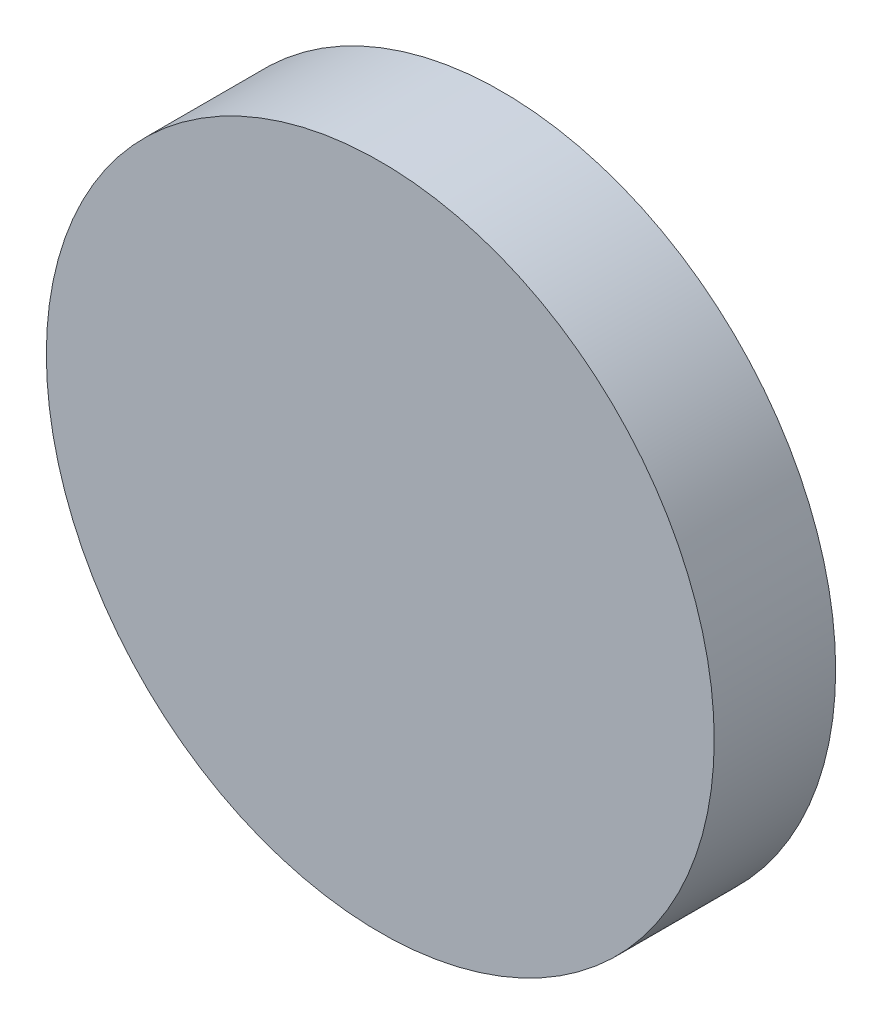
ISO-10303-21;
HEADER;
FILE_DESCRIPTION(('STEP AP214'),'2;1');
FILE_NAME('part.step','',(''),(''),'','','');
FILE_SCHEMA(('AUTOMOTIVE_DESIGN { 1 0 10303 214 1 1 1 1 }'));
ENDSEC;
DATA;
#1=APPLICATION_CONTEXT('core data for automotive mechanical design processes');
#2=APPLICATION_PROTOCOL_DEFINITION('international standard','automotive_design',2000,#1);
#3=PRODUCT_CONTEXT('',#1,'mechanical');
#4=PRODUCT('Part','Part','',(#3));
#5=PRODUCT_RELATED_PRODUCT_CATEGORY('part','',(#4));
#6=PRODUCT_DEFINITION_FORMATION('','',#4);
#7=PRODUCT_DEFINITION_CONTEXT('part definition',#1,'design');
#8=PRODUCT_DEFINITION('design','',#6,#7);
#9=PRODUCT_DEFINITION_SHAPE('','',#8);
#10=(LENGTH_UNIT() NAMED_UNIT(*) SI_UNIT(.MILLI.,.METRE.));
#11=(NAMED_UNIT(*) PLANE_ANGLE_UNIT() SI_UNIT($,.RADIAN.));
#12=(NAMED_UNIT(*) SI_UNIT($,.STERADIAN.) SOLID_ANGLE_UNIT());
#13=UNCERTAINTY_MEASURE_WITH_UNIT(LENGTH_MEASURE(1.E-05),#10,'distance_accuracy_value','');
#14=(GEOMETRIC_REPRESENTATION_CONTEXT(3) GLOBAL_UNCERTAINTY_ASSIGNED_CONTEXT((#13)) GLOBAL_UNIT_ASSIGNED_CONTEXT((#10,
#11,#12)) REPRESENTATION_CONTEXT('',''));
#15=CARTESIAN_POINT('',(0.,0.,0.));
#16=DIRECTION('',(0.,0.,1.));
#17=DIRECTION('',(1.,0.,0.));
#18=AXIS2_PLACEMENT_3D('',#15,#16,#17);
#19=CARTESIAN_POINT('',(0.,0.,12.7));
#20=DIRECTION('',(0.,0.,-1.));
#21=DIRECTION('',(-1.,0.,0.));
#22=AXIS2_PLACEMENT_3D('',#19,#20,#21);
#23=CYLINDRICAL_SURFACE('',#22,34.925);
#24=CARTESIAN_POINT('',(0.,0.,12.7));
#25=DIRECTION('',(0.,0.,1.));
#26=DIRECTION('',(1.,0.,0.));
#27=AXIS2_PLACEMENT_3D('',#24,#25,#26);
#28=CIRCLE('',#27,34.925);
#29=CARTESIAN_POINT('',(34.925,0.,12.7));
#30=VERTEX_POINT('',#29);
#31=EDGE_CURVE('E10',#30,#30,#28,.T.);
#32=ORIENTED_EDGE('',*,*,#31,.F.);
#33=EDGE_LOOP('',(#32));
#34=FACE_BOUND('',#33,.T.);
#35=CARTESIAN_POINT('',(0.,0.,0.));
#36=DIRECTION('',(0.,0.,1.));
#37=DIRECTION('',(1.,0.,0.));
#38=AXIS2_PLACEMENT_3D('',#35,#36,#37);
#39=CIRCLE('',#38,34.925);
#40=CARTESIAN_POINT('',(34.925,0.,0.));
#41=VERTEX_POINT('',#40);
#42=EDGE_CURVE('E37',#41,#41,#39,.T.);
#43=ORIENTED_EDGE('',*,*,#42,.T.);
#44=EDGE_LOOP('',(#43));
#45=FACE_BOUND('',#44,.T.);
#46=ADVANCED_FACE('F34',(#34,#45),#23,.T.);
#47=CARTESIAN_POINT('',(0.,0.,12.7));
#48=DIRECTION('',(0.,0.,1.));
#49=DIRECTION('',(1.,0.,0.));
#50=AXIS2_PLACEMENT_3D('',#47,#48,#49);
#51=PLANE('',#50);
#52=ORIENTED_EDGE('',*,*,#31,.T.);
#53=EDGE_LOOP('',(#52));
#54=FACE_BOUND('',#53,.T.);
#55=ADVANCED_FACE('F49',(#54),#51,.T.);
#56=CARTESIAN_POINT('',(0.,0.,0.));
#57=DIRECTION('',(0.,0.,1.));
#58=DIRECTION('',(1.,0.,0.));
#59=AXIS2_PLACEMENT_3D('',#56,#57,#58);
#60=PLANE('',#59);
#61=ORIENTED_EDGE('',*,*,#42,.F.);
#62=EDGE_LOOP('',(#61));
#63=FACE_BOUND('',#62,.T.);
#64=ADVANCED_FACE('F47',(#63),#60,.F.);
#65=CLOSED_SHELL('',(#46,#55,#64));
#66=MANIFOLD_SOLID_BREP('B2',#65);
#67=ADVANCED_BREP_SHAPE_REPRESENTATION('',(#18,#66),#14);
#68=SHAPE_DEFINITION_REPRESENTATION(#9,#67);
ENDSEC;
END-ISO-10303-21;
